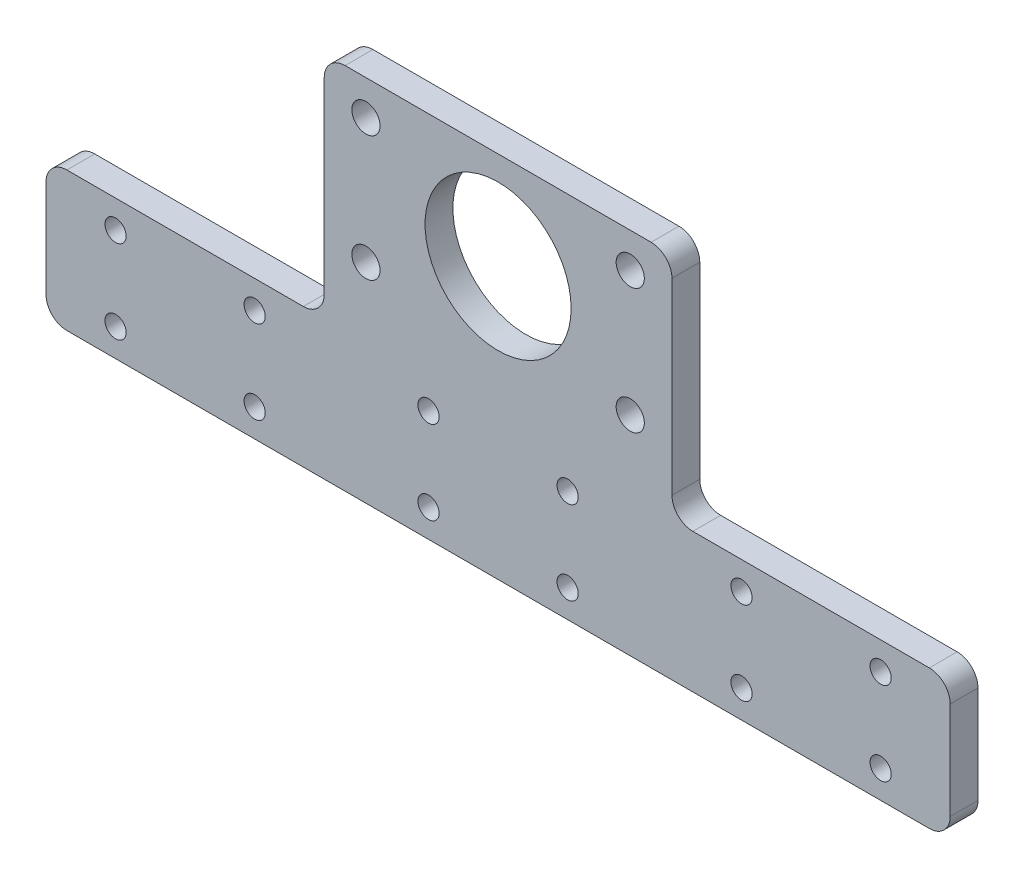
ISO-10303-21;
HEADER;
FILE_DESCRIPTION(('STEP AP214'),'2;1');
FILE_NAME('part.step','',(''),(''),'','','');
FILE_SCHEMA(('AUTOMOTIVE_DESIGN { 1 0 10303 214 1 1 1 1 }'));
ENDSEC;
DATA;
#1=APPLICATION_CONTEXT('core data for automotive mechanical design processes');
#2=APPLICATION_PROTOCOL_DEFINITION('international standard','automotive_design',2000,#1);
#3=PRODUCT_CONTEXT('',#1,'mechanical');
#4=PRODUCT('Part','Part','',(#3));
#5=PRODUCT_RELATED_PRODUCT_CATEGORY('part','',(#4));
#6=PRODUCT_DEFINITION_FORMATION('','',#4);
#7=PRODUCT_DEFINITION_CONTEXT('part definition',#1,'design');
#8=PRODUCT_DEFINITION('design','',#6,#7);
#9=PRODUCT_DEFINITION_SHAPE('','',#8);
#10=(LENGTH_UNIT() NAMED_UNIT(*) SI_UNIT(.MILLI.,.METRE.));
#11=(NAMED_UNIT(*) PLANE_ANGLE_UNIT() SI_UNIT($,.RADIAN.));
#12=(NAMED_UNIT(*) SI_UNIT($,.STERADIAN.) SOLID_ANGLE_UNIT());
#13=UNCERTAINTY_MEASURE_WITH_UNIT(LENGTH_MEASURE(1.E-05),#10,'distance_accuracy_value','');
#14=(GEOMETRIC_REPRESENTATION_CONTEXT(3) GLOBAL_UNCERTAINTY_ASSIGNED_CONTEXT((#13)) GLOBAL_UNIT_ASSIGNED_CONTEXT((#10,
#11,#12)) REPRESENTATION_CONTEXT('',''));
#15=CARTESIAN_POINT('',(0.,0.,0.));
#16=DIRECTION('',(0.,0.,1.));
#17=DIRECTION('',(1.,0.,0.));
#18=AXIS2_PLACEMENT_3D('',#15,#16,#17);
#19=CARTESIAN_POINT('',(-25.,-33.,2.));
#20=DIRECTION('',(1.,0.,0.));
#21=DIRECTION('',(0.,1.,0.));
#22=AXIS2_PLACEMENT_3D('',#19,#20,#21);
#23=PLANE('',#22);
#24=DIRECTION('',(0.,-1.,0.));
#25=VECTOR('',#24,1.);
#26=CARTESIAN_POINT('',(-25.,-33.,-2.));
#27=LINE('',#26,#25);
#28=CARTESIAN_POINT('',(-25.,-3.,-2.));
#29=VERTEX_POINT('',#28);
#30=CARTESIAN_POINT('',(-25.,-30.,-2.));
#31=VERTEX_POINT('',#30);
#32=EDGE_CURVE('E241',#29,#31,#27,.T.);
#33=ORIENTED_EDGE('',*,*,#32,.T.);
#34=DIRECTION('',(0.,0.,-1.));
#35=VECTOR('',#34,1.);
#36=CARTESIAN_POINT('',(-25.,-30.,2.));
#37=LINE('',#36,#35);
#38=CARTESIAN_POINT('',(-25.,-30.,2.));
#39=VERTEX_POINT('',#38);
#40=EDGE_CURVE('E234',#31,#39,#37,.F.);
#41=ORIENTED_EDGE('',*,*,#40,.T.);
#42=DIRECTION('',(0.,-1.,0.));
#43=VECTOR('',#42,1.);
#44=CARTESIAN_POINT('',(-25.,-33.,2.));
#45=LINE('',#44,#43);
#46=CARTESIAN_POINT('',(-25.,-3.,2.));
#47=VERTEX_POINT('',#46);
#48=EDGE_CURVE('E174',#47,#39,#45,.T.);
#49=ORIENTED_EDGE('',*,*,#48,.F.);
#50=DIRECTION('',(0.,0.,-1.));
#51=VECTOR('',#50,1.);
#52=CARTESIAN_POINT('',(-25.,-3.,2.));
#53=LINE('',#52,#51);
#54=EDGE_CURVE('E231',#47,#29,#53,.T.);
#55=ORIENTED_EDGE('',*,*,#54,.T.);
#56=EDGE_LOOP('',(#33,#41,#49,#55));
#57=FACE_BOUND('',#56,.T.);
#58=ADVANCED_FACE('F34',(#57),#23,.F.);
#59=CARTESIAN_POINT('',(-65.,-33.,2.));
#60=DIRECTION('',(0.,-1.,0.));
#61=DIRECTION('',(0.,0.,-1.));
#62=AXIS2_PLACEMENT_3D('',#59,#60,#61);
#63=PLANE('',#62);
#64=DIRECTION('',(-1.,0.,0.));
#65=VECTOR('',#64,1.);
#66=CARTESIAN_POINT('',(-65.,-33.,-2.));
#67=LINE('',#66,#65);
#68=CARTESIAN_POINT('',(-28.,-33.,-2.));
#69=VERTEX_POINT('',#68);
#70=CARTESIAN_POINT('',(-62.,-33.,-2.));
#71=VERTEX_POINT('',#70);
#72=EDGE_CURVE('E243',#69,#71,#67,.T.);
#73=ORIENTED_EDGE('',*,*,#72,.T.);
#74=DIRECTION('',(0.,0.,-1.));
#75=VECTOR('',#74,1.);
#76=CARTESIAN_POINT('',(-62.,-33.,2.));
#77=LINE('',#76,#75);
#78=CARTESIAN_POINT('',(-62.,-33.,2.));
#79=VERTEX_POINT('',#78);
#80=EDGE_CURVE('E229',#71,#79,#77,.F.);
#81=ORIENTED_EDGE('',*,*,#80,.T.);
#82=DIRECTION('',(-1.,0.,0.));
#83=VECTOR('',#82,1.);
#84=CARTESIAN_POINT('',(-65.,-33.,2.));
#85=LINE('',#84,#83);
#86=CARTESIAN_POINT('',(-28.,-33.,2.));
#87=VERTEX_POINT('',#86);
#88=EDGE_CURVE('E178',#87,#79,#85,.T.);
#89=ORIENTED_EDGE('',*,*,#88,.F.);
#90=DIRECTION('',(0.,0.,-1.));
#91=VECTOR('',#90,1.);
#92=CARTESIAN_POINT('',(-28.,-33.,-2.));
#93=LINE('',#92,#91);
#94=EDGE_CURVE('E226',#87,#69,#93,.T.);
#95=ORIENTED_EDGE('',*,*,#94,.T.);
#96=EDGE_LOOP('',(#73,#81,#89,#95));
#97=FACE_BOUND('',#96,.T.);
#98=ADVANCED_FACE('F260',(#97),#63,.F.);
#99=CARTESIAN_POINT('',(-65.,-53.,2.));
#100=DIRECTION('',(1.,0.,0.));
#101=DIRECTION('',(0.,0.,-1.));
#102=AXIS2_PLACEMENT_3D('',#99,#100,#101);
#103=PLANE('',#102);
#104=DIRECTION('',(0.,-1.,0.));
#105=VECTOR('',#104,1.);
#106=CARTESIAN_POINT('',(-65.,-53.,-2.));
#107=LINE('',#106,#105);
#108=CARTESIAN_POINT('',(-65.,-36.,-2.));
#109=VERTEX_POINT('',#108);
#110=CARTESIAN_POINT('',(-65.,-50.,-2.));
#111=VERTEX_POINT('',#110);
#112=EDGE_CURVE('E279',#109,#111,#107,.T.);
#113=ORIENTED_EDGE('',*,*,#112,.T.);
#114=DIRECTION('',(0.,0.,-1.));
#115=VECTOR('',#114,1.);
#116=CARTESIAN_POINT('',(-65.,-50.,2.));
#117=LINE('',#116,#115);
#118=CARTESIAN_POINT('',(-65.,-50.,2.));
#119=VERTEX_POINT('',#118);
#120=EDGE_CURVE('E224',#111,#119,#117,.F.);
#121=ORIENTED_EDGE('',*,*,#120,.T.);
#122=DIRECTION('',(0.,-1.,0.));
#123=VECTOR('',#122,1.);
#124=CARTESIAN_POINT('',(-65.,-53.,2.));
#125=LINE('',#124,#123);
#126=CARTESIAN_POINT('',(-65.,-36.,2.));
#127=VERTEX_POINT('',#126);
#128=EDGE_CURVE('E262',#127,#119,#125,.T.);
#129=ORIENTED_EDGE('',*,*,#128,.F.);
#130=DIRECTION('',(0.,0.,-1.));
#131=VECTOR('',#130,1.);
#132=CARTESIAN_POINT('',(-65.,-36.,2.));
#133=LINE('',#132,#131);
#134=EDGE_CURVE('E221',#127,#109,#133,.T.);
#135=ORIENTED_EDGE('',*,*,#134,.T.);
#136=EDGE_LOOP('',(#113,#121,#129,#135));
#137=FACE_BOUND('',#136,.T.);
#138=ADVANCED_FACE('F311',(#137),#103,.F.);
#139=CARTESIAN_POINT('',(65.,-53.,2.));
#140=DIRECTION('',(0.,1.,0.));
#141=DIRECTION('',(0.,0.,1.));
#142=AXIS2_PLACEMENT_3D('',#139,#140,#141);
#143=PLANE('',#142);
#144=DIRECTION('',(1.,0.,0.));
#145=VECTOR('',#144,1.);
#146=CARTESIAN_POINT('',(65.,-53.,-2.));
#147=LINE('',#146,#145);
#148=CARTESIAN_POINT('',(-62.,-53.,-2.));
#149=VERTEX_POINT('',#148);
#150=CARTESIAN_POINT('',(62.,-53.,-2.));
#151=VERTEX_POINT('',#150);
#152=EDGE_CURVE('E282',#149,#151,#147,.T.);
#153=ORIENTED_EDGE('',*,*,#152,.T.);
#154=DIRECTION('',(0.,0.,-1.));
#155=VECTOR('',#154,1.);
#156=CARTESIAN_POINT('',(62.,-53.,2.));
#157=LINE('',#156,#155);
#158=CARTESIAN_POINT('',(62.,-53.,2.));
#159=VERTEX_POINT('',#158);
#160=EDGE_CURVE('E219',#151,#159,#157,.F.);
#161=ORIENTED_EDGE('',*,*,#160,.T.);
#162=DIRECTION('',(1.,0.,0.));
#163=VECTOR('',#162,1.);
#164=CARTESIAN_POINT('',(65.,-53.,2.));
#165=LINE('',#164,#163);
#166=CARTESIAN_POINT('',(-62.,-53.,2.));
#167=VERTEX_POINT('',#166);
#168=EDGE_CURVE('E265',#167,#159,#165,.T.);
#169=ORIENTED_EDGE('',*,*,#168,.F.);
#170=DIRECTION('',(0.,0.,-1.));
#171=VECTOR('',#170,1.);
#172=CARTESIAN_POINT('',(-62.,-53.,2.));
#173=LINE('',#172,#171);
#174=EDGE_CURVE('E216',#167,#149,#173,.T.);
#175=ORIENTED_EDGE('',*,*,#174,.T.);
#176=EDGE_LOOP('',(#153,#161,#169,#175));
#177=FACE_BOUND('',#176,.T.);
#178=ADVANCED_FACE('F740',(#177),#143,.F.);
#179=CARTESIAN_POINT('',(65.,-33.,2.));
#180=DIRECTION('',(-1.,0.,0.));
#181=DIRECTION('',(0.,0.,1.));
#182=AXIS2_PLACEMENT_3D('',#179,#180,#181);
#183=PLANE('',#182);
#184=DIRECTION('',(0.,1.,0.));
#185=VECTOR('',#184,1.);
#186=CARTESIAN_POINT('',(65.,-33.,-2.));
#187=LINE('',#186,#185);
#188=CARTESIAN_POINT('',(65.,-50.,-2.));
#189=VERTEX_POINT('',#188);
#190=CARTESIAN_POINT('',(65.,-36.,-2.));
#191=VERTEX_POINT('',#190);
#192=EDGE_CURVE('E285',#189,#191,#187,.T.);
#193=ORIENTED_EDGE('',*,*,#192,.T.);
#194=DIRECTION('',(0.,0.,-1.));
#195=VECTOR('',#194,1.);
#196=CARTESIAN_POINT('',(65.,-36.,2.));
#197=LINE('',#196,#195);
#198=CARTESIAN_POINT('',(65.,-36.,2.));
#199=VERTEX_POINT('',#198);
#200=EDGE_CURVE('E214',#191,#199,#197,.F.);
#201=ORIENTED_EDGE('',*,*,#200,.T.);
#202=DIRECTION('',(0.,1.,0.));
#203=VECTOR('',#202,1.);
#204=CARTESIAN_POINT('',(65.,-33.,2.));
#205=LINE('',#204,#203);
#206=CARTESIAN_POINT('',(65.,-50.,2.));
#207=VERTEX_POINT('',#206);
#208=EDGE_CURVE('E271',#207,#199,#205,.T.);
#209=ORIENTED_EDGE('',*,*,#208,.F.);
#210=DIRECTION('',(0.,0.,-1.));
#211=VECTOR('',#210,1.);
#212=CARTESIAN_POINT('',(65.,-50.,2.));
#213=LINE('',#212,#211);
#214=EDGE_CURVE('E211',#207,#189,#213,.T.);
#215=ORIENTED_EDGE('',*,*,#214,.T.);
#216=EDGE_LOOP('',(#193,#201,#209,#215));
#217=FACE_BOUND('',#216,.T.);
#218=ADVANCED_FACE('F304',(#217),#183,.F.);
#219=CARTESIAN_POINT('',(25.,-33.,2.));
#220=DIRECTION('',(0.,-1.,0.));
#221=DIRECTION('',(0.,0.,-1.));
#222=AXIS2_PLACEMENT_3D('',#219,#220,#221);
#223=PLANE('',#222);
#224=DIRECTION('',(-1.,0.,0.));
#225=VECTOR('',#224,1.);
#226=CARTESIAN_POINT('',(25.,-33.,-2.));
#227=LINE('',#226,#225);
#228=CARTESIAN_POINT('',(62.,-33.,-2.));
#229=VERTEX_POINT('',#228);
#230=CARTESIAN_POINT('',(28.,-33.,-2.));
#231=VERTEX_POINT('',#230);
#232=EDGE_CURVE('E180',#229,#231,#227,.T.);
#233=ORIENTED_EDGE('',*,*,#232,.T.);
#234=DIRECTION('',(0.,0.,-1.));
#235=VECTOR('',#234,1.);
#236=CARTESIAN_POINT('',(28.,-33.,2.));
#237=LINE('',#236,#235);
#238=CARTESIAN_POINT('',(28.,-33.,2.));
#239=VERTEX_POINT('',#238);
#240=EDGE_CURVE('E49',#231,#239,#237,.F.);
#241=ORIENTED_EDGE('',*,*,#240,.T.);
#242=DIRECTION('',(-1.,0.,0.));
#243=VECTOR('',#242,1.);
#244=CARTESIAN_POINT('',(25.,-33.,2.));
#245=LINE('',#244,#243);
#246=CARTESIAN_POINT('',(62.,-33.,2.));
#247=VERTEX_POINT('',#246);
#248=EDGE_CURVE('E273',#247,#239,#245,.T.);
#249=ORIENTED_EDGE('',*,*,#248,.F.);
#250=DIRECTION('',(0.,0.,-1.));
#251=VECTOR('',#250,1.);
#252=CARTESIAN_POINT('',(62.,-33.,2.));
#253=LINE('',#252,#251);
#254=EDGE_CURVE('E207',#247,#229,#253,.T.);
#255=ORIENTED_EDGE('',*,*,#254,.T.);
#256=EDGE_LOOP('',(#233,#241,#249,#255));
#257=FACE_BOUND('',#256,.T.);
#258=ADVANCED_FACE('F288',(#257),#223,.F.);
#259=CARTESIAN_POINT('',(25.,0.,2.));
#260=DIRECTION('',(-1.,0.,0.));
#261=DIRECTION('',(0.,-1.,0.));
#262=AXIS2_PLACEMENT_3D('',#259,#260,#261);
#263=PLANE('',#262);
#264=DIRECTION('',(0.,1.,0.));
#265=VECTOR('',#264,1.);
#266=CARTESIAN_POINT('',(25.,0.,-2.));
#267=LINE('',#266,#265);
#268=CARTESIAN_POINT('',(25.,-30.,-2.));
#269=VERTEX_POINT('',#268);
#270=CARTESIAN_POINT('',(25.,-3.,-2.));
#271=VERTEX_POINT('',#270);
#272=EDGE_CURVE('E175',#269,#271,#267,.T.);
#273=ORIENTED_EDGE('',*,*,#272,.T.);
#274=DIRECTION('',(0.,0.,-1.));
#275=VECTOR('',#274,1.);
#276=CARTESIAN_POINT('',(25.,-3.,2.));
#277=LINE('',#276,#275);
#278=CARTESIAN_POINT('',(25.,-3.,2.));
#279=VERTEX_POINT('',#278);
#280=EDGE_CURVE('E153',#271,#279,#277,.F.);
#281=ORIENTED_EDGE('',*,*,#280,.T.);
#282=DIRECTION('',(0.,1.,0.));
#283=VECTOR('',#282,1.);
#284=CARTESIAN_POINT('',(25.,0.,2.));
#285=LINE('',#284,#283);
#286=CARTESIAN_POINT('',(25.,-30.,2.));
#287=VERTEX_POINT('',#286);
#288=EDGE_CURVE('E275',#287,#279,#285,.T.);
#289=ORIENTED_EDGE('',*,*,#288,.F.);
#290=DIRECTION('',(0.,0.,-1.));
#291=VECTOR('',#290,1.);
#292=CARTESIAN_POINT('',(25.,-30.,-2.));
#293=LINE('',#292,#291);
#294=EDGE_CURVE('E158',#287,#269,#293,.T.);
#295=ORIENTED_EDGE('',*,*,#294,.T.);
#296=EDGE_LOOP('',(#273,#281,#289,#295));
#297=FACE_BOUND('',#296,.T.);
#298=ADVANCED_FACE('F296',(#297),#263,.F.);
#299=CARTESIAN_POINT('',(-25.,0.,2.));
#300=DIRECTION('',(0.,-1.,0.));
#301=DIRECTION('',(0.,0.,-1.));
#302=AXIS2_PLACEMENT_3D('',#299,#300,#301);
#303=PLANE('',#302);
#304=DIRECTION('',(-1.,0.,0.));
#305=VECTOR('',#304,1.);
#306=CARTESIAN_POINT('',(-25.,0.,2.));
#307=LINE('',#306,#305);
#308=CARTESIAN_POINT('',(22.,0.,2.));
#309=VERTEX_POINT('',#308);
#310=CARTESIAN_POINT('',(-22.,0.,2.));
#311=VERTEX_POINT('',#310);
#312=EDGE_CURVE('E168',#309,#311,#307,.T.);
#313=ORIENTED_EDGE('',*,*,#312,.F.);
#314=DIRECTION('',(0.,0.,-1.));
#315=VECTOR('',#314,1.);
#316=CARTESIAN_POINT('',(22.,0.,2.));
#317=LINE('',#316,#315);
#318=CARTESIAN_POINT('',(22.,0.,-2.));
#319=VERTEX_POINT('',#318);
#320=EDGE_CURVE('E152',#309,#319,#317,.T.);
#321=ORIENTED_EDGE('',*,*,#320,.T.);
#322=DIRECTION('',(-1.,0.,0.));
#323=VECTOR('',#322,1.);
#324=CARTESIAN_POINT('',(-25.,0.,-2.));
#325=LINE('',#324,#323);
#326=CARTESIAN_POINT('',(-22.,0.,-2.));
#327=VERTEX_POINT('',#326);
#328=EDGE_CURVE('E165',#319,#327,#325,.T.);
#329=ORIENTED_EDGE('',*,*,#328,.T.);
#330=DIRECTION('',(0.,0.,-1.));
#331=VECTOR('',#330,1.);
#332=CARTESIAN_POINT('',(-22.,0.,2.));
#333=LINE('',#332,#331);
#334=EDGE_CURVE('E170',#327,#311,#333,.F.);
#335=ORIENTED_EDGE('',*,*,#334,.T.);
#336=EDGE_LOOP('',(#313,#321,#329,#335));
#337=FACE_BOUND('',#336,.T.);
#338=ADVANCED_FACE('F164',(#337),#303,.F.);
#339=CARTESIAN_POINT('',(0.,0.,2.));
#340=DIRECTION('',(0.,0.,-1.));
#341=DIRECTION('',(-1.,0.,0.));
#342=AXIS2_PLACEMENT_3D('',#339,#340,#341);
#343=PLANE('',#342);
#344=CARTESIAN_POINT('',(0.,-14.,2.));
#345=DIRECTION('',(0.,0.,1.));
#346=DIRECTION('',(1.,0.,0.));
#347=AXIS2_PLACEMENT_3D('',#344,#345,#346);
#348=CIRCLE('',#347,10.5);
#349=CARTESIAN_POINT('',(10.5,-14.,2.));
#350=VERTEX_POINT('',#349);
#351=EDGE_CURVE('E512',#350,#350,#348,.T.);
#352=ORIENTED_EDGE('',*,*,#351,.F.);
#353=EDGE_LOOP('',(#352));
#354=FACE_BOUND('',#353,.T.);
#355=CARTESIAN_POINT('',(-10.,-37.,2.));
#356=DIRECTION('',(0.,0.,-1.));
#357=DIRECTION('',(-1.,0.,0.));
#358=AXIS2_PLACEMENT_3D('',#355,#356,#357);
#359=CIRCLE('',#358,1.525);
#360=CARTESIAN_POINT('',(-11.525,-37.,2.));
#361=VERTEX_POINT('',#360);
#362=EDGE_CURVE('E561',#361,#361,#359,.T.);
#363=ORIENTED_EDGE('',*,*,#362,.T.);
#364=EDGE_LOOP('',(#363));
#365=FACE_BOUND('',#364,.T.);
#366=CARTESIAN_POINT('',(-35.,-37.,2.));
#367=DIRECTION('',(0.,0.,-1.));
#368=DIRECTION('',(-1.,0.,0.));
#369=AXIS2_PLACEMENT_3D('',#366,#367,#368);
#370=CIRCLE('',#369,1.525);
#371=CARTESIAN_POINT('',(-36.525,-37.,2.));
#372=VERTEX_POINT('',#371);
#373=EDGE_CURVE('E558',#372,#372,#370,.T.);
#374=ORIENTED_EDGE('',*,*,#373,.T.);
#375=EDGE_LOOP('',(#374));
#376=FACE_BOUND('',#375,.T.);
#377=CARTESIAN_POINT('',(-55.,-37.,2.));
#378=DIRECTION('',(0.,0.,-1.));
#379=DIRECTION('',(-1.,0.,0.));
#380=AXIS2_PLACEMENT_3D('',#377,#378,#379);
#381=CIRCLE('',#380,1.525);
#382=CARTESIAN_POINT('',(-56.525,-37.,2.));
#383=VERTEX_POINT('',#382);
#384=EDGE_CURVE('E555',#383,#383,#381,.T.);
#385=ORIENTED_EDGE('',*,*,#384,.T.);
#386=EDGE_LOOP('',(#385));
#387=FACE_BOUND('',#386,.T.);
#388=CARTESIAN_POINT('',(-55.,-49.,2.));
#389=DIRECTION('',(0.,0.,-1.));
#390=DIRECTION('',(-1.,0.,0.));
#391=AXIS2_PLACEMENT_3D('',#388,#389,#390);
#392=CIRCLE('',#391,1.525);
#393=CARTESIAN_POINT('',(-56.525,-49.,2.));
#394=VERTEX_POINT('',#393);
#395=EDGE_CURVE('E552',#394,#394,#392,.T.);
#396=ORIENTED_EDGE('',*,*,#395,.T.);
#397=EDGE_LOOP('',(#396));
#398=FACE_BOUND('',#397,.T.);
#399=CARTESIAN_POINT('',(-35.,-49.,2.));
#400=DIRECTION('',(0.,0.,-1.));
#401=DIRECTION('',(-1.,0.,0.));
#402=AXIS2_PLACEMENT_3D('',#399,#400,#401);
#403=CIRCLE('',#402,1.525);
#404=CARTESIAN_POINT('',(-36.525,-49.,2.));
#405=VERTEX_POINT('',#404);
#406=EDGE_CURVE('E549',#405,#405,#403,.T.);
#407=ORIENTED_EDGE('',*,*,#406,.T.);
#408=EDGE_LOOP('',(#407));
#409=FACE_BOUND('',#408,.T.);
#410=CARTESIAN_POINT('',(-10.,-49.,2.));
#411=DIRECTION('',(0.,0.,-1.));
#412=DIRECTION('',(-1.,0.,0.));
#413=AXIS2_PLACEMENT_3D('',#410,#411,#412);
#414=CIRCLE('',#413,1.525);
#415=CARTESIAN_POINT('',(-11.525,-49.,2.));
#416=VERTEX_POINT('',#415);
#417=EDGE_CURVE('E546',#416,#416,#414,.T.);
#418=ORIENTED_EDGE('',*,*,#417,.T.);
#419=EDGE_LOOP('',(#418));
#420=FACE_BOUND('',#419,.T.);
#421=CARTESIAN_POINT('',(9.99999999999999,-49.,2.));
#422=DIRECTION('',(0.,0.,-1.));
#423=DIRECTION('',(-1.,0.,0.));
#424=AXIS2_PLACEMENT_3D('',#421,#422,#423);
#425=CIRCLE('',#424,1.525);
#426=CARTESIAN_POINT('',(8.47499999999999,-49.,2.));
#427=VERTEX_POINT('',#426);
#428=EDGE_CURVE('E543',#427,#427,#425,.T.);
#429=ORIENTED_EDGE('',*,*,#428,.T.);
#430=EDGE_LOOP('',(#429));
#431=FACE_BOUND('',#430,.T.);
#432=CARTESIAN_POINT('',(35.,-49.,2.));
#433=DIRECTION('',(0.,0.,-1.));
#434=DIRECTION('',(-1.,0.,0.));
#435=AXIS2_PLACEMENT_3D('',#432,#433,#434);
#436=CIRCLE('',#435,1.525);
#437=CARTESIAN_POINT('',(33.475,-49.,2.));
#438=VERTEX_POINT('',#437);
#439=EDGE_CURVE('E540',#438,#438,#436,.T.);
#440=ORIENTED_EDGE('',*,*,#439,.T.);
#441=EDGE_LOOP('',(#440));
#442=FACE_BOUND('',#441,.T.);
#443=CARTESIAN_POINT('',(9.99999999999999,-37.,2.));
#444=DIRECTION('',(0.,0.,-1.));
#445=DIRECTION('',(-1.,0.,0.));
#446=AXIS2_PLACEMENT_3D('',#443,#444,#445);
#447=CIRCLE('',#446,1.525);
#448=CARTESIAN_POINT('',(8.47499999999999,-37.,2.));
#449=VERTEX_POINT('',#448);
#450=EDGE_CURVE('E537',#449,#449,#447,.T.);
#451=ORIENTED_EDGE('',*,*,#450,.T.);
#452=EDGE_LOOP('',(#451));
#453=FACE_BOUND('',#452,.T.);
#454=CARTESIAN_POINT('',(35.,-37.,2.));
#455=DIRECTION('',(0.,0.,-1.));
#456=DIRECTION('',(-1.,0.,0.));
#457=AXIS2_PLACEMENT_3D('',#454,#455,#456);
#458=CIRCLE('',#457,1.525);
#459=CARTESIAN_POINT('',(33.475,-37.,2.));
#460=VERTEX_POINT('',#459);
#461=EDGE_CURVE('E534',#460,#460,#458,.T.);
#462=ORIENTED_EDGE('',*,*,#461,.T.);
#463=EDGE_LOOP('',(#462));
#464=FACE_BOUND('',#463,.T.);
#465=CARTESIAN_POINT('',(55.,-37.,2.));
#466=DIRECTION('',(0.,0.,-1.));
#467=DIRECTION('',(-1.,0.,0.));
#468=AXIS2_PLACEMENT_3D('',#465,#466,#467);
#469=CIRCLE('',#468,1.525);
#470=CARTESIAN_POINT('',(53.475,-37.,2.));
#471=VERTEX_POINT('',#470);
#472=EDGE_CURVE('E531',#471,#471,#469,.T.);
#473=ORIENTED_EDGE('',*,*,#472,.T.);
#474=EDGE_LOOP('',(#473));
#475=FACE_BOUND('',#474,.T.);
#476=CARTESIAN_POINT('',(55.,-49.,2.));
#477=DIRECTION('',(0.,0.,-1.));
#478=DIRECTION('',(-1.,0.,0.));
#479=AXIS2_PLACEMENT_3D('',#476,#477,#478);
#480=CIRCLE('',#479,1.525);
#481=CARTESIAN_POINT('',(53.475,-49.,2.));
#482=VERTEX_POINT('',#481);
#483=EDGE_CURVE('E528',#482,#482,#480,.T.);
#484=ORIENTED_EDGE('',*,*,#483,.T.);
#485=EDGE_LOOP('',(#484));
#486=FACE_BOUND('',#485,.T.);
#487=CARTESIAN_POINT('',(-19.,-23.,2.));
#488=DIRECTION('',(0.,0.,-1.));
#489=DIRECTION('',(-1.,0.,0.));
#490=AXIS2_PLACEMENT_3D('',#487,#488,#489);
#491=CIRCLE('',#490,2.025);
#492=CARTESIAN_POINT('',(-21.025,-23.,2.));
#493=VERTEX_POINT('',#492);
#494=EDGE_CURVE('E250',#493,#493,#491,.T.);
#495=ORIENTED_EDGE('',*,*,#494,.T.);
#496=EDGE_LOOP('',(#495));
#497=FACE_BOUND('',#496,.T.);
#498=CARTESIAN_POINT('',(19.,-5.,2.));
#499=DIRECTION('',(0.,0.,-1.));
#500=DIRECTION('',(-1.,0.,0.));
#501=AXIS2_PLACEMENT_3D('',#498,#499,#500);
#502=CIRCLE('',#501,2.025);
#503=CARTESIAN_POINT('',(16.975,-5.,2.));
#504=VERTEX_POINT('',#503);
#505=EDGE_CURVE('E441',#504,#504,#502,.T.);
#506=ORIENTED_EDGE('',*,*,#505,.T.);
#507=EDGE_LOOP('',(#506));
#508=FACE_BOUND('',#507,.T.);
#509=CARTESIAN_POINT('',(19.,-23.,2.));
#510=DIRECTION('',(0.,0.,-1.));
#511=DIRECTION('',(-1.,0.,0.));
#512=AXIS2_PLACEMENT_3D('',#509,#510,#511);
#513=CIRCLE('',#512,2.025);
#514=CARTESIAN_POINT('',(16.975,-23.,2.));
#515=VERTEX_POINT('',#514);
#516=EDGE_CURVE('E434',#515,#515,#513,.T.);
#517=ORIENTED_EDGE('',*,*,#516,.T.);
#518=EDGE_LOOP('',(#517));
#519=FACE_BOUND('',#518,.T.);
#520=CARTESIAN_POINT('',(-19.,-5.,2.));
#521=DIRECTION('',(0.,0.,-1.));
#522=DIRECTION('',(-1.,0.,0.));
#523=AXIS2_PLACEMENT_3D('',#520,#521,#522);
#524=CIRCLE('',#523,2.025);
#525=CARTESIAN_POINT('',(-21.025,-5.,2.));
#526=VERTEX_POINT('',#525);
#527=EDGE_CURVE('E431',#526,#526,#524,.T.);
#528=ORIENTED_EDGE('',*,*,#527,.T.);
#529=EDGE_LOOP('',(#528));
#530=FACE_BOUND('',#529,.T.);
#531=ORIENTED_EDGE('',*,*,#288,.T.);
#532=CARTESIAN_POINT('',(22.,-3.,2.));
#533=DIRECTION('',(0.,0.,-1.));
#534=DIRECTION('',(-1.,0.,0.));
#535=AXIS2_PLACEMENT_3D('',#532,#533,#534);
#536=CIRCLE('',#535,3.);
#537=EDGE_CURVE('E205',#279,#309,#536,.F.);
#538=ORIENTED_EDGE('',*,*,#537,.T.);
#539=ORIENTED_EDGE('',*,*,#312,.T.);
#540=CARTESIAN_POINT('',(-22.,-3.,2.));
#541=DIRECTION('',(0.,0.,-1.));
#542=DIRECTION('',(-1.,0.,0.));
#543=AXIS2_PLACEMENT_3D('',#540,#541,#542);
#544=CIRCLE('',#543,3.);
#545=EDGE_CURVE('E196',#311,#47,#544,.F.);
#546=ORIENTED_EDGE('',*,*,#545,.T.);
#547=ORIENTED_EDGE('',*,*,#48,.T.);
#548=CARTESIAN_POINT('',(-28.,-30.,2.));
#549=DIRECTION('',(0.,0.,-1.));
#550=DIRECTION('',(-1.,0.,0.));
#551=AXIS2_PLACEMENT_3D('',#548,#549,#550);
#552=CIRCLE('',#551,3.);
#553=EDGE_CURVE('E11',#39,#87,#552,.T.);
#554=ORIENTED_EDGE('',*,*,#553,.T.);
#555=ORIENTED_EDGE('',*,*,#88,.T.);
#556=CARTESIAN_POINT('',(-62.,-36.,2.));
#557=DIRECTION('',(0.,0.,-1.));
#558=DIRECTION('',(-1.,0.,0.));
#559=AXIS2_PLACEMENT_3D('',#556,#557,#558);
#560=CIRCLE('',#559,3.);
#561=EDGE_CURVE('E198',#79,#127,#560,.F.);
#562=ORIENTED_EDGE('',*,*,#561,.T.);
#563=ORIENTED_EDGE('',*,*,#128,.T.);
#564=CARTESIAN_POINT('',(-62.,-50.,2.));
#565=DIRECTION('',(0.,0.,-1.));
#566=DIRECTION('',(-1.,0.,0.));
#567=AXIS2_PLACEMENT_3D('',#564,#565,#566);
#568=CIRCLE('',#567,3.);
#569=EDGE_CURVE('E200',#119,#167,#568,.F.);
#570=ORIENTED_EDGE('',*,*,#569,.T.);
#571=ORIENTED_EDGE('',*,*,#168,.T.);
#572=CARTESIAN_POINT('',(62.,-50.,2.));
#573=DIRECTION('',(0.,0.,-1.));
#574=DIRECTION('',(-1.,0.,0.));
#575=AXIS2_PLACEMENT_3D('',#572,#573,#574);
#576=CIRCLE('',#575,3.);
#577=EDGE_CURVE('E202',#159,#207,#576,.F.);
#578=ORIENTED_EDGE('',*,*,#577,.T.);
#579=ORIENTED_EDGE('',*,*,#208,.T.);
#580=CARTESIAN_POINT('',(62.,-36.,2.));
#581=DIRECTION('',(0.,0.,-1.));
#582=DIRECTION('',(-1.,0.,0.));
#583=AXIS2_PLACEMENT_3D('',#580,#581,#582);
#584=CIRCLE('',#583,3.);
#585=EDGE_CURVE('E56',#199,#247,#584,.F.);
#586=ORIENTED_EDGE('',*,*,#585,.T.);
#587=ORIENTED_EDGE('',*,*,#248,.T.);
#588=CARTESIAN_POINT('',(28.,-30.,2.));
#589=DIRECTION('',(0.,0.,-1.));
#590=DIRECTION('',(-1.,0.,0.));
#591=AXIS2_PLACEMENT_3D('',#588,#589,#590);
#592=CIRCLE('',#591,3.);
#593=EDGE_CURVE('E238',#239,#287,#592,.T.);
#594=ORIENTED_EDGE('',*,*,#593,.T.);
#595=EDGE_LOOP('',(#531,#538,#539,#546,#547,#554,#555,#562,#563,#570,#571,#578,#579,#586,#587,#594));
#596=FACE_BOUND('',#595,.T.);
#597=ADVANCED_FACE('F257',(#354,#365,#376,#387,#398,#409,#420,#431,#442,#453,#464,#475,#486,
#497,#508,#519,#530,#596),#343,.F.);
#598=CARTESIAN_POINT('',(0.,0.,-2.));
#599=DIRECTION('',(0.,0.,-1.));
#600=DIRECTION('',(-1.,0.,0.));
#601=AXIS2_PLACEMENT_3D('',#598,#599,#600);
#602=PLANE('',#601);
#603=CARTESIAN_POINT('',(0.,-14.,-2.));
#604=DIRECTION('',(0.,0.,1.));
#605=DIRECTION('',(1.,0.,0.));
#606=AXIS2_PLACEMENT_3D('',#603,#604,#605);
#607=CIRCLE('',#606,10.5);
#608=CARTESIAN_POINT('',(10.5,-14.,-2.));
#609=VERTEX_POINT('',#608);
#610=EDGE_CURVE('E368',#609,#609,#607,.T.);
#611=ORIENTED_EDGE('',*,*,#610,.T.);
#612=EDGE_LOOP('',(#611));
#613=FACE_BOUND('',#612,.T.);
#614=CARTESIAN_POINT('',(-10.,-37.,-2.));
#615=DIRECTION('',(0.,0.,-1.));
#616=DIRECTION('',(1.,0.,0.));
#617=AXIS2_PLACEMENT_3D('',#614,#615,#616);
#618=CIRCLE('',#617,1.525);
#619=CARTESIAN_POINT('',(-8.475,-37.,-2.));
#620=VERTEX_POINT('',#619);
#621=EDGE_CURVE('E372',#620,#620,#618,.T.);
#622=ORIENTED_EDGE('',*,*,#621,.F.);
#623=EDGE_LOOP('',(#622));
#624=FACE_BOUND('',#623,.T.);
#625=CARTESIAN_POINT('',(-35.,-37.,-2.));
#626=DIRECTION('',(0.,0.,-1.));
#627=DIRECTION('',(1.,0.,0.));
#628=AXIS2_PLACEMENT_3D('',#625,#626,#627);
#629=CIRCLE('',#628,1.525);
#630=CARTESIAN_POINT('',(-33.475,-37.,-2.));
#631=VERTEX_POINT('',#630);
#632=EDGE_CURVE('E376',#631,#631,#629,.T.);
#633=ORIENTED_EDGE('',*,*,#632,.F.);
#634=EDGE_LOOP('',(#633));
#635=FACE_BOUND('',#634,.T.);
#636=CARTESIAN_POINT('',(-55.,-37.,-2.));
#637=DIRECTION('',(0.,0.,-1.));
#638=DIRECTION('',(1.,0.,0.));
#639=AXIS2_PLACEMENT_3D('',#636,#637,#638);
#640=CIRCLE('',#639,1.525);
#641=CARTESIAN_POINT('',(-53.475,-37.,-2.));
#642=VERTEX_POINT('',#641);
#643=EDGE_CURVE('E380',#642,#642,#640,.T.);
#644=ORIENTED_EDGE('',*,*,#643,.F.);
#645=EDGE_LOOP('',(#644));
#646=FACE_BOUND('',#645,.T.);
#647=CARTESIAN_POINT('',(-55.,-49.,-2.));
#648=DIRECTION('',(0.,0.,-1.));
#649=DIRECTION('',(-1.,0.,0.));
#650=AXIS2_PLACEMENT_3D('',#647,#648,#649);
#651=CIRCLE('',#650,1.525);
#652=CARTESIAN_POINT('',(-56.525,-49.,-2.));
#653=VERTEX_POINT('',#652);
#654=EDGE_CURVE('E384',#653,#653,#651,.T.);
#655=ORIENTED_EDGE('',*,*,#654,.F.);
#656=EDGE_LOOP('',(#655));
#657=FACE_BOUND('',#656,.T.);
#658=CARTESIAN_POINT('',(-35.,-49.,-2.));
#659=DIRECTION('',(0.,0.,-1.));
#660=DIRECTION('',(-1.,0.,0.));
#661=AXIS2_PLACEMENT_3D('',#658,#659,#660);
#662=CIRCLE('',#661,1.525);
#663=CARTESIAN_POINT('',(-36.525,-49.,-2.));
#664=VERTEX_POINT('',#663);
#665=EDGE_CURVE('E388',#664,#664,#662,.T.);
#666=ORIENTED_EDGE('',*,*,#665,.F.);
#667=EDGE_LOOP('',(#666));
#668=FACE_BOUND('',#667,.T.);
#669=CARTESIAN_POINT('',(-10.,-49.,-2.));
#670=DIRECTION('',(0.,0.,-1.));
#671=DIRECTION('',(-1.,0.,0.));
#672=AXIS2_PLACEMENT_3D('',#669,#670,#671);
#673=CIRCLE('',#672,1.525);
#674=CARTESIAN_POINT('',(-11.525,-49.,-2.));
#675=VERTEX_POINT('',#674);
#676=EDGE_CURVE('E392',#675,#675,#673,.T.);
#677=ORIENTED_EDGE('',*,*,#676,.F.);
#678=EDGE_LOOP('',(#677));
#679=FACE_BOUND('',#678,.T.);
#680=CARTESIAN_POINT('',(9.99999999999999,-49.,-2.));
#681=DIRECTION('',(0.,0.,-1.));
#682=DIRECTION('',(-1.,0.,0.));
#683=AXIS2_PLACEMENT_3D('',#680,#681,#682);
#684=CIRCLE('',#683,1.525);
#685=CARTESIAN_POINT('',(8.47499999999999,-49.,-2.));
#686=VERTEX_POINT('',#685);
#687=EDGE_CURVE('E396',#686,#686,#684,.T.);
#688=ORIENTED_EDGE('',*,*,#687,.F.);
#689=EDGE_LOOP('',(#688));
#690=FACE_BOUND('',#689,.T.);
#691=CARTESIAN_POINT('',(35.,-49.,-2.));
#692=DIRECTION('',(0.,0.,-1.));
#693=DIRECTION('',(-1.,0.,0.));
#694=AXIS2_PLACEMENT_3D('',#691,#692,#693);
#695=CIRCLE('',#694,1.525);
#696=CARTESIAN_POINT('',(33.475,-49.,-2.));
#697=VERTEX_POINT('',#696);
#698=EDGE_CURVE('E400',#697,#697,#695,.T.);
#699=ORIENTED_EDGE('',*,*,#698,.F.);
#700=EDGE_LOOP('',(#699));
#701=FACE_BOUND('',#700,.T.);
#702=CARTESIAN_POINT('',(9.99999999999999,-37.,-2.));
#703=DIRECTION('',(0.,0.,-1.));
#704=DIRECTION('',(1.,0.,0.));
#705=AXIS2_PLACEMENT_3D('',#702,#703,#704);
#706=CIRCLE('',#705,1.525);
#707=CARTESIAN_POINT('',(11.525,-37.,-2.));
#708=VERTEX_POINT('',#707);
#709=EDGE_CURVE('E404',#708,#708,#706,.T.);
#710=ORIENTED_EDGE('',*,*,#709,.F.);
#711=EDGE_LOOP('',(#710));
#712=FACE_BOUND('',#711,.T.);
#713=CARTESIAN_POINT('',(35.,-37.,-2.));
#714=DIRECTION('',(0.,0.,-1.));
#715=DIRECTION('',(1.,0.,0.));
#716=AXIS2_PLACEMENT_3D('',#713,#714,#715);
#717=CIRCLE('',#716,1.525);
#718=CARTESIAN_POINT('',(36.525,-37.,-2.));
#719=VERTEX_POINT('',#718);
#720=EDGE_CURVE('E408',#719,#719,#717,.T.);
#721=ORIENTED_EDGE('',*,*,#720,.F.);
#722=EDGE_LOOP('',(#721));
#723=FACE_BOUND('',#722,.T.);
#724=CARTESIAN_POINT('',(55.,-37.,-2.));
#725=DIRECTION('',(0.,0.,-1.));
#726=DIRECTION('',(1.,0.,0.));
#727=AXIS2_PLACEMENT_3D('',#724,#725,#726);
#728=CIRCLE('',#727,1.525);
#729=CARTESIAN_POINT('',(56.525,-37.,-2.));
#730=VERTEX_POINT('',#729);
#731=EDGE_CURVE('E412',#730,#730,#728,.T.);
#732=ORIENTED_EDGE('',*,*,#731,.F.);
#733=EDGE_LOOP('',(#732));
#734=FACE_BOUND('',#733,.T.);
#735=CARTESIAN_POINT('',(55.,-49.,-2.));
#736=DIRECTION('',(0.,0.,-1.));
#737=DIRECTION('',(-1.,0.,0.));
#738=AXIS2_PLACEMENT_3D('',#735,#736,#737);
#739=CIRCLE('',#738,1.525);
#740=CARTESIAN_POINT('',(53.475,-49.,-2.));
#741=VERTEX_POINT('',#740);
#742=EDGE_CURVE('E416',#741,#741,#739,.T.);
#743=ORIENTED_EDGE('',*,*,#742,.F.);
#744=EDGE_LOOP('',(#743));
#745=FACE_BOUND('',#744,.T.);
#746=CARTESIAN_POINT('',(-19.,-23.,-2.));
#747=DIRECTION('',(0.,0.,1.));
#748=DIRECTION('',(1.,0.,0.));
#749=AXIS2_PLACEMENT_3D('',#746,#747,#748);
#750=CIRCLE('',#749,2.025);
#751=CARTESIAN_POINT('',(-16.975,-23.,-2.));
#752=VERTEX_POINT('',#751);
#753=EDGE_CURVE('E420',#752,#752,#750,.T.);
#754=ORIENTED_EDGE('',*,*,#753,.T.);
#755=EDGE_LOOP('',(#754));
#756=FACE_BOUND('',#755,.T.);
#757=CARTESIAN_POINT('',(19.,-5.,-2.));
#758=DIRECTION('',(0.,0.,1.));
#759=DIRECTION('',(1.,0.,0.));
#760=AXIS2_PLACEMENT_3D('',#757,#758,#759);
#761=CIRCLE('',#760,2.025);
#762=CARTESIAN_POINT('',(21.025,-5.,-2.));
#763=VERTEX_POINT('',#762);
#764=EDGE_CURVE('E424',#763,#763,#761,.T.);
#765=ORIENTED_EDGE('',*,*,#764,.T.);
#766=EDGE_LOOP('',(#765));
#767=FACE_BOUND('',#766,.T.);
#768=CARTESIAN_POINT('',(19.,-23.,-2.));
#769=DIRECTION('',(0.,0.,1.));
#770=DIRECTION('',(1.,0.,0.));
#771=AXIS2_PLACEMENT_3D('',#768,#769,#770);
#772=CIRCLE('',#771,2.025);
#773=CARTESIAN_POINT('',(21.025,-23.,-2.));
#774=VERTEX_POINT('',#773);
#775=EDGE_CURVE('E428',#774,#774,#772,.T.);
#776=ORIENTED_EDGE('',*,*,#775,.T.);
#777=EDGE_LOOP('',(#776));
#778=FACE_BOUND('',#777,.T.);
#779=CARTESIAN_POINT('',(-19.,-5.,-2.));
#780=DIRECTION('',(0.,0.,1.));
#781=DIRECTION('',(1.,0.,0.));
#782=AXIS2_PLACEMENT_3D('',#779,#780,#781);
#783=CIRCLE('',#782,2.025);
#784=CARTESIAN_POINT('',(-16.975,-5.,-2.));
#785=VERTEX_POINT('',#784);
#786=EDGE_CURVE('E430',#785,#785,#783,.T.);
#787=ORIENTED_EDGE('',*,*,#786,.T.);
#788=EDGE_LOOP('',(#787));
#789=FACE_BOUND('',#788,.T.);
#790=ORIENTED_EDGE('',*,*,#328,.F.);
#791=CARTESIAN_POINT('',(22.,-3.,-2.));
#792=DIRECTION('',(0.,0.,-1.));
#793=DIRECTION('',(-1.,0.,0.));
#794=AXIS2_PLACEMENT_3D('',#791,#792,#793);
#795=CIRCLE('',#794,3.);
#796=EDGE_CURVE('E148',#319,#271,#795,.T.);
#797=ORIENTED_EDGE('',*,*,#796,.T.);
#798=ORIENTED_EDGE('',*,*,#272,.F.);
#799=CARTESIAN_POINT('',(28.,-30.,-2.));
#800=DIRECTION('',(0.,0.,-1.));
#801=DIRECTION('',(-1.,0.,0.));
#802=AXIS2_PLACEMENT_3D('',#799,#800,#801);
#803=CIRCLE('',#802,3.);
#804=EDGE_CURVE('E236',#269,#231,#803,.F.);
#805=ORIENTED_EDGE('',*,*,#804,.T.);
#806=ORIENTED_EDGE('',*,*,#232,.F.);
#807=CARTESIAN_POINT('',(62.,-36.,-2.));
#808=DIRECTION('',(0.,0.,-1.));
#809=DIRECTION('',(-1.,0.,0.));
#810=AXIS2_PLACEMENT_3D('',#807,#808,#809);
#811=CIRCLE('',#810,3.);
#812=EDGE_CURVE('E159',#229,#191,#811,.T.);
#813=ORIENTED_EDGE('',*,*,#812,.T.);
#814=ORIENTED_EDGE('',*,*,#192,.F.);
#815=CARTESIAN_POINT('',(62.,-50.,-2.));
#816=DIRECTION('',(0.,0.,-1.));
#817=DIRECTION('',(-1.,0.,0.));
#818=AXIS2_PLACEMENT_3D('',#815,#816,#817);
#819=CIRCLE('',#818,3.);
#820=EDGE_CURVE('E190',#189,#151,#819,.T.);
#821=ORIENTED_EDGE('',*,*,#820,.T.);
#822=ORIENTED_EDGE('',*,*,#152,.F.);
#823=CARTESIAN_POINT('',(-62.,-50.,-2.));
#824=DIRECTION('',(0.,0.,-1.));
#825=DIRECTION('',(-1.,0.,0.));
#826=AXIS2_PLACEMENT_3D('',#823,#824,#825);
#827=CIRCLE('',#826,3.);
#828=EDGE_CURVE('E188',#149,#111,#827,.T.);
#829=ORIENTED_EDGE('',*,*,#828,.T.);
#830=ORIENTED_EDGE('',*,*,#112,.F.);
#831=CARTESIAN_POINT('',(-62.,-36.,-2.));
#832=DIRECTION('',(0.,0.,-1.));
#833=DIRECTION('',(-1.,0.,0.));
#834=AXIS2_PLACEMENT_3D('',#831,#832,#833);
#835=CIRCLE('',#834,3.);
#836=EDGE_CURVE('E186',#109,#71,#835,.T.);
#837=ORIENTED_EDGE('',*,*,#836,.T.);
#838=ORIENTED_EDGE('',*,*,#72,.F.);
#839=CARTESIAN_POINT('',(-28.,-30.,-2.));
#840=DIRECTION('',(0.,0.,-1.));
#841=DIRECTION('',(-1.,0.,0.));
#842=AXIS2_PLACEMENT_3D('',#839,#840,#841);
#843=CIRCLE('',#842,3.);
#844=EDGE_CURVE('E42',#69,#31,#843,.F.);
#845=ORIENTED_EDGE('',*,*,#844,.T.);
#846=ORIENTED_EDGE('',*,*,#32,.F.);
#847=CARTESIAN_POINT('',(-22.,-3.,-2.));
#848=DIRECTION('',(0.,0.,-1.));
#849=DIRECTION('',(-1.,0.,0.));
#850=AXIS2_PLACEMENT_3D('',#847,#848,#849);
#851=CIRCLE('',#850,3.);
#852=EDGE_CURVE('E169',#29,#327,#851,.T.);
#853=ORIENTED_EDGE('',*,*,#852,.T.);
#854=EDGE_LOOP('',(#790,#797,#798,#805,#806,#813,#814,#821,#822,#829,#830,#837,#838,#845,#846,#853));
#855=FACE_BOUND('',#854,.T.);
#856=ADVANCED_FACE('F172',(#613,#624,#635,#646,#657,#668,#679,#690,#701,#712,#723,#734,#745,
#756,#767,#778,#789,#855),#602,.T.);
#857=CARTESIAN_POINT('',(22.,-3.,2.));
#858=DIRECTION('',(0.,0.,-1.));
#859=DIRECTION('',(-1.,0.,0.));
#860=AXIS2_PLACEMENT_3D('',#857,#858,#859);
#861=CYLINDRICAL_SURFACE('',#860,3.);
#862=ORIENTED_EDGE('',*,*,#537,.F.);
#863=ORIENTED_EDGE('',*,*,#280,.F.);
#864=ORIENTED_EDGE('',*,*,#796,.F.);
#865=ORIENTED_EDGE('',*,*,#320,.F.);
#866=EDGE_LOOP('',(#862,#863,#864,#865));
#867=FACE_BOUND('',#866,.T.);
#868=ADVANCED_FACE('F151',(#867),#861,.T.);
#869=CARTESIAN_POINT('',(28.,-30.,2.));
#870=DIRECTION('',(0.,0.,1.));
#871=DIRECTION('',(1.,0.,0.));
#872=AXIS2_PLACEMENT_3D('',#869,#870,#871);
#873=CYLINDRICAL_SURFACE('',#872,3.);
#874=ORIENTED_EDGE('',*,*,#593,.F.);
#875=ORIENTED_EDGE('',*,*,#240,.F.);
#876=ORIENTED_EDGE('',*,*,#804,.F.);
#877=ORIENTED_EDGE('',*,*,#294,.F.);
#878=EDGE_LOOP('',(#874,#875,#876,#877));
#879=FACE_BOUND('',#878,.T.);
#880=ADVANCED_FACE('F292',(#879),#873,.F.);
#881=CARTESIAN_POINT('',(62.,-36.,2.));
#882=DIRECTION('',(0.,0.,-1.));
#883=DIRECTION('',(-1.,0.,0.));
#884=AXIS2_PLACEMENT_3D('',#881,#882,#883);
#885=CYLINDRICAL_SURFACE('',#884,3.);
#886=ORIENTED_EDGE('',*,*,#585,.F.);
#887=ORIENTED_EDGE('',*,*,#200,.F.);
#888=ORIENTED_EDGE('',*,*,#812,.F.);
#889=ORIENTED_EDGE('',*,*,#254,.F.);
#890=EDGE_LOOP('',(#886,#887,#888,#889));
#891=FACE_BOUND('',#890,.T.);
#892=ADVANCED_FACE('F319',(#891),#885,.T.);
#893=CARTESIAN_POINT('',(62.,-50.,2.));
#894=DIRECTION('',(0.,0.,-1.));
#895=DIRECTION('',(-1.,0.,0.));
#896=AXIS2_PLACEMENT_3D('',#893,#894,#895);
#897=CYLINDRICAL_SURFACE('',#896,3.);
#898=ORIENTED_EDGE('',*,*,#577,.F.);
#899=ORIENTED_EDGE('',*,*,#160,.F.);
#900=ORIENTED_EDGE('',*,*,#820,.F.);
#901=ORIENTED_EDGE('',*,*,#214,.F.);
#902=EDGE_LOOP('',(#898,#899,#900,#901));
#903=FACE_BOUND('',#902,.T.);
#904=ADVANCED_FACE('F322',(#903),#897,.T.);
#905=CARTESIAN_POINT('',(-62.,-50.,2.));
#906=DIRECTION('',(0.,0.,-1.));
#907=DIRECTION('',(-1.,0.,0.));
#908=AXIS2_PLACEMENT_3D('',#905,#906,#907);
#909=CYLINDRICAL_SURFACE('',#908,3.);
#910=ORIENTED_EDGE('',*,*,#569,.F.);
#911=ORIENTED_EDGE('',*,*,#120,.F.);
#912=ORIENTED_EDGE('',*,*,#828,.F.);
#913=ORIENTED_EDGE('',*,*,#174,.F.);
#914=EDGE_LOOP('',(#910,#911,#912,#913));
#915=FACE_BOUND('',#914,.T.);
#916=ADVANCED_FACE('F326',(#915),#909,.T.);
#917=CARTESIAN_POINT('',(-62.,-36.,2.));
#918=DIRECTION('',(0.,0.,-1.));
#919=DIRECTION('',(-1.,0.,0.));
#920=AXIS2_PLACEMENT_3D('',#917,#918,#919);
#921=CYLINDRICAL_SURFACE('',#920,3.);
#922=ORIENTED_EDGE('',*,*,#561,.F.);
#923=ORIENTED_EDGE('',*,*,#80,.F.);
#924=ORIENTED_EDGE('',*,*,#836,.F.);
#925=ORIENTED_EDGE('',*,*,#134,.F.);
#926=EDGE_LOOP('',(#922,#923,#924,#925));
#927=FACE_BOUND('',#926,.T.);
#928=ADVANCED_FACE('F330',(#927),#921,.T.);
#929=CARTESIAN_POINT('',(-28.,-30.,2.));
#930=DIRECTION('',(0.,0.,1.));
#931=DIRECTION('',(1.,0.,0.));
#932=AXIS2_PLACEMENT_3D('',#929,#930,#931);
#933=CYLINDRICAL_SURFACE('',#932,3.);
#934=ORIENTED_EDGE('',*,*,#553,.F.);
#935=ORIENTED_EDGE('',*,*,#40,.F.);
#936=ORIENTED_EDGE('',*,*,#844,.F.);
#937=ORIENTED_EDGE('',*,*,#94,.F.);
#938=EDGE_LOOP('',(#934,#935,#936,#937));
#939=FACE_BOUND('',#938,.T.);
#940=ADVANCED_FACE('F253',(#939),#933,.F.);
#941=CARTESIAN_POINT('',(-22.,-3.,2.));
#942=DIRECTION('',(0.,0.,-1.));
#943=DIRECTION('',(-1.,0.,0.));
#944=AXIS2_PLACEMENT_3D('',#941,#942,#943);
#945=CYLINDRICAL_SURFACE('',#944,3.);
#946=ORIENTED_EDGE('',*,*,#545,.F.);
#947=ORIENTED_EDGE('',*,*,#334,.F.);
#948=ORIENTED_EDGE('',*,*,#852,.F.);
#949=ORIENTED_EDGE('',*,*,#54,.F.);
#950=EDGE_LOOP('',(#946,#947,#948,#949));
#951=FACE_BOUND('',#950,.T.);
#952=ADVANCED_FACE('F36',(#951),#945,.T.);
#953=CARTESIAN_POINT('',(-19.,-5.,-2.));
#954=DIRECTION('',(0.,0.,1.));
#955=DIRECTION('',(1.,0.,0.));
#956=AXIS2_PLACEMENT_3D('',#953,#954,#955);
#957=CYLINDRICAL_SURFACE('',#956,2.025);
#958=ORIENTED_EDGE('',*,*,#786,.F.);
#959=EDGE_LOOP('',(#958));
#960=FACE_BOUND('',#959,.T.);
#961=ORIENTED_EDGE('',*,*,#527,.F.);
#962=EDGE_LOOP('',(#961));
#963=FACE_BOUND('',#962,.T.);
#964=ADVANCED_FACE('F338',(#960,#963),#957,.F.);
#965=CARTESIAN_POINT('',(19.,-23.,-2.));
#966=DIRECTION('',(0.,0.,1.));
#967=DIRECTION('',(1.,0.,0.));
#968=AXIS2_PLACEMENT_3D('',#965,#966,#967);
#969=CYLINDRICAL_SURFACE('',#968,2.025);
#970=ORIENTED_EDGE('',*,*,#775,.F.);
#971=EDGE_LOOP('',(#970));
#972=FACE_BOUND('',#971,.T.);
#973=ORIENTED_EDGE('',*,*,#516,.F.);
#974=EDGE_LOOP('',(#973));
#975=FACE_BOUND('',#974,.T.);
#976=ADVANCED_FACE('F343',(#972,#975),#969,.F.);
#977=CARTESIAN_POINT('',(19.,-5.,-2.));
#978=DIRECTION('',(0.,0.,1.));
#979=DIRECTION('',(1.,0.,0.));
#980=AXIS2_PLACEMENT_3D('',#977,#978,#979);
#981=CYLINDRICAL_SURFACE('',#980,2.025);
#982=ORIENTED_EDGE('',*,*,#764,.F.);
#983=EDGE_LOOP('',(#982));
#984=FACE_BOUND('',#983,.T.);
#985=ORIENTED_EDGE('',*,*,#505,.F.);
#986=EDGE_LOOP('',(#985));
#987=FACE_BOUND('',#986,.T.);
#988=ADVANCED_FACE('F350',(#984,#987),#981,.F.);
#989=CARTESIAN_POINT('',(-19.,-23.,-2.));
#990=DIRECTION('',(0.,0.,1.));
#991=DIRECTION('',(1.,0.,0.));
#992=AXIS2_PLACEMENT_3D('',#989,#990,#991);
#993=CYLINDRICAL_SURFACE('',#992,2.025);
#994=ORIENTED_EDGE('',*,*,#753,.F.);
#995=EDGE_LOOP('',(#994));
#996=FACE_BOUND('',#995,.T.);
#997=ORIENTED_EDGE('',*,*,#494,.F.);
#998=EDGE_LOOP('',(#997));
#999=FACE_BOUND('',#998,.T.);
#1000=ADVANCED_FACE('F448',(#996,#999),#993,.F.);
#1001=CARTESIAN_POINT('',(55.,-49.,8.));
#1002=DIRECTION('',(0.,0.,-1.));
#1003=DIRECTION('',(-1.,0.,0.));
#1004=AXIS2_PLACEMENT_3D('',#1001,#1002,#1003);
#1005=CYLINDRICAL_SURFACE('',#1004,1.525);
#1006=ORIENTED_EDGE('',*,*,#742,.T.);
#1007=EDGE_LOOP('',(#1006));
#1008=FACE_BOUND('',#1007,.T.);
#1009=ORIENTED_EDGE('',*,*,#483,.F.);
#1010=EDGE_LOOP('',(#1009));
#1011=FACE_BOUND('',#1010,.T.);
#1012=ADVANCED_FACE('F450',(#1008,#1011),#1005,.F.);
#1013=CARTESIAN_POINT('',(55.,-37.,8.));
#1014=DIRECTION('',(0.,0.,-1.));
#1015=DIRECTION('',(-1.,0.,0.));
#1016=AXIS2_PLACEMENT_3D('',#1013,#1014,#1015);
#1017=CYLINDRICAL_SURFACE('',#1016,1.525);
#1018=ORIENTED_EDGE('',*,*,#731,.T.);
#1019=EDGE_LOOP('',(#1018));
#1020=FACE_BOUND('',#1019,.T.);
#1021=ORIENTED_EDGE('',*,*,#472,.F.);
#1022=EDGE_LOOP('',(#1021));
#1023=FACE_BOUND('',#1022,.T.);
#1024=ADVANCED_FACE('F456',(#1020,#1023),#1017,.F.);
#1025=CARTESIAN_POINT('',(35.,-37.,8.));
#1026=DIRECTION('',(0.,0.,-1.));
#1027=DIRECTION('',(-1.,0.,0.));
#1028=AXIS2_PLACEMENT_3D('',#1025,#1026,#1027);
#1029=CYLINDRICAL_SURFACE('',#1028,1.525);
#1030=ORIENTED_EDGE('',*,*,#720,.T.);
#1031=EDGE_LOOP('',(#1030));
#1032=FACE_BOUND('',#1031,.T.);
#1033=ORIENTED_EDGE('',*,*,#461,.F.);
#1034=EDGE_LOOP('',(#1033));
#1035=FACE_BOUND('',#1034,.T.);
#1036=ADVANCED_FACE('F497',(#1032,#1035),#1029,.F.);
#1037=CARTESIAN_POINT('',(9.99999999999999,-37.,8.));
#1038=DIRECTION('',(0.,0.,-1.));
#1039=DIRECTION('',(-1.,0.,0.));
#1040=AXIS2_PLACEMENT_3D('',#1037,#1038,#1039);
#1041=CYLINDRICAL_SURFACE('',#1040,1.525);
#1042=ORIENTED_EDGE('',*,*,#709,.T.);
#1043=EDGE_LOOP('',(#1042));
#1044=FACE_BOUND('',#1043,.T.);
#1045=ORIENTED_EDGE('',*,*,#450,.F.);
#1046=EDGE_LOOP('',(#1045));
#1047=FACE_BOUND('',#1046,.T.);
#1048=ADVANCED_FACE('F477',(#1044,#1047),#1041,.F.);
#1049=CARTESIAN_POINT('',(35.,-49.,8.));
#1050=DIRECTION('',(0.,0.,-1.));
#1051=DIRECTION('',(-1.,0.,0.));
#1052=AXIS2_PLACEMENT_3D('',#1049,#1050,#1051);
#1053=CYLINDRICAL_SURFACE('',#1052,1.525);
#1054=ORIENTED_EDGE('',*,*,#698,.T.);
#1055=EDGE_LOOP('',(#1054));
#1056=FACE_BOUND('',#1055,.T.);
#1057=ORIENTED_EDGE('',*,*,#439,.F.);
#1058=EDGE_LOOP('',(#1057));
#1059=FACE_BOUND('',#1058,.T.);
#1060=ADVANCED_FACE('F473',(#1056,#1059),#1053,.F.);
#1061=CARTESIAN_POINT('',(9.99999999999999,-49.,8.));
#1062=DIRECTION('',(0.,0.,-1.));
#1063=DIRECTION('',(-1.,0.,0.));
#1064=AXIS2_PLACEMENT_3D('',#1061,#1062,#1063);
#1065=CYLINDRICAL_SURFACE('',#1064,1.525);
#1066=ORIENTED_EDGE('',*,*,#687,.T.);
#1067=EDGE_LOOP('',(#1066));
#1068=FACE_BOUND('',#1067,.T.);
#1069=ORIENTED_EDGE('',*,*,#428,.F.);
#1070=EDGE_LOOP('',(#1069));
#1071=FACE_BOUND('',#1070,.T.);
#1072=ADVANCED_FACE('F469',(#1068,#1071),#1065,.F.);
#1073=CARTESIAN_POINT('',(-10.,-49.,8.));
#1074=DIRECTION('',(0.,0.,-1.));
#1075=DIRECTION('',(-1.,0.,0.));
#1076=AXIS2_PLACEMENT_3D('',#1073,#1074,#1075);
#1077=CYLINDRICAL_SURFACE('',#1076,1.525);
#1078=ORIENTED_EDGE('',*,*,#676,.T.);
#1079=EDGE_LOOP('',(#1078));
#1080=FACE_BOUND('',#1079,.T.);
#1081=ORIENTED_EDGE('',*,*,#417,.F.);
#1082=EDGE_LOOP('',(#1081));
#1083=FACE_BOUND('',#1082,.T.);
#1084=ADVANCED_FACE('F465',(#1080,#1083),#1077,.F.);
#1085=CARTESIAN_POINT('',(-35.,-49.,8.));
#1086=DIRECTION('',(0.,0.,-1.));
#1087=DIRECTION('',(-1.,0.,0.));
#1088=AXIS2_PLACEMENT_3D('',#1085,#1086,#1087);
#1089=CYLINDRICAL_SURFACE('',#1088,1.525);
#1090=ORIENTED_EDGE('',*,*,#665,.T.);
#1091=EDGE_LOOP('',(#1090));
#1092=FACE_BOUND('',#1091,.T.);
#1093=ORIENTED_EDGE('',*,*,#406,.F.);
#1094=EDGE_LOOP('',(#1093));
#1095=FACE_BOUND('',#1094,.T.);
#1096=ADVANCED_FACE('F461',(#1092,#1095),#1089,.F.);
#1097=CARTESIAN_POINT('',(-55.,-49.,8.));
#1098=DIRECTION('',(0.,0.,-1.));
#1099=DIRECTION('',(-1.,0.,0.));
#1100=AXIS2_PLACEMENT_3D('',#1097,#1098,#1099);
#1101=CYLINDRICAL_SURFACE('',#1100,1.525);
#1102=ORIENTED_EDGE('',*,*,#654,.T.);
#1103=EDGE_LOOP('',(#1102));
#1104=FACE_BOUND('',#1103,.T.);
#1105=ORIENTED_EDGE('',*,*,#395,.F.);
#1106=EDGE_LOOP('',(#1105));
#1107=FACE_BOUND('',#1106,.T.);
#1108=ADVANCED_FACE('F464',(#1104,#1107),#1101,.F.);
#1109=CARTESIAN_POINT('',(-55.,-37.,8.));
#1110=DIRECTION('',(0.,0.,-1.));
#1111=DIRECTION('',(-1.,0.,0.));
#1112=AXIS2_PLACEMENT_3D('',#1109,#1110,#1111);
#1113=CYLINDRICAL_SURFACE('',#1112,1.525);
#1114=ORIENTED_EDGE('',*,*,#643,.T.);
#1115=EDGE_LOOP('',(#1114));
#1116=FACE_BOUND('',#1115,.T.);
#1117=ORIENTED_EDGE('',*,*,#384,.F.);
#1118=EDGE_LOOP('',(#1117));
#1119=FACE_BOUND('',#1118,.T.);
#1120=ADVANCED_FACE('F487',(#1116,#1119),#1113,.F.);
#1121=CARTESIAN_POINT('',(-35.,-37.,8.));
#1122=DIRECTION('',(0.,0.,-1.));
#1123=DIRECTION('',(-1.,0.,0.));
#1124=AXIS2_PLACEMENT_3D('',#1121,#1122,#1123);
#1125=CYLINDRICAL_SURFACE('',#1124,1.525);
#1126=ORIENTED_EDGE('',*,*,#632,.T.);
#1127=EDGE_LOOP('',(#1126));
#1128=FACE_BOUND('',#1127,.T.);
#1129=ORIENTED_EDGE('',*,*,#373,.F.);
#1130=EDGE_LOOP('',(#1129));
#1131=FACE_BOUND('',#1130,.T.);
#1132=ADVANCED_FACE('F483',(#1128,#1131),#1125,.F.);
#1133=CARTESIAN_POINT('',(-10.,-37.,8.));
#1134=DIRECTION('',(0.,0.,-1.));
#1135=DIRECTION('',(-1.,0.,0.));
#1136=AXIS2_PLACEMENT_3D('',#1133,#1134,#1135);
#1137=CYLINDRICAL_SURFACE('',#1136,1.525);
#1138=ORIENTED_EDGE('',*,*,#621,.T.);
#1139=EDGE_LOOP('',(#1138));
#1140=FACE_BOUND('',#1139,.T.);
#1141=ORIENTED_EDGE('',*,*,#362,.F.);
#1142=EDGE_LOOP('',(#1141));
#1143=FACE_BOUND('',#1142,.T.);
#1144=ADVANCED_FACE('F479',(#1140,#1143),#1137,.F.);
#1145=CARTESIAN_POINT('',(0.,-14.,-2.));
#1146=DIRECTION('',(0.,0.,1.));
#1147=DIRECTION('',(1.,0.,0.));
#1148=AXIS2_PLACEMENT_3D('',#1145,#1146,#1147);
#1149=CYLINDRICAL_SURFACE('',#1148,10.5);
#1150=ORIENTED_EDGE('',*,*,#610,.F.);
#1151=EDGE_LOOP('',(#1150));
#1152=FACE_BOUND('',#1151,.T.);
#1153=ORIENTED_EDGE('',*,*,#351,.T.);
#1154=EDGE_LOOP('',(#1153));
#1155=FACE_BOUND('',#1154,.T.);
#1156=ADVANCED_FACE('F482',(#1152,#1155),#1149,.F.);
#1157=CLOSED_SHELL('',(#58,#98,#138,#178,#218,#258,#298,#338,#597,#856,#868,#880,#892,#904,#916,
#928,#940,#952,#964,#976,#988,#1000,#1012,#1024,#1036,#1048,#1060,#1072,#1084,#1096,#1108,#1120,
#1132,#1144,#1156));
#1158=MANIFOLD_SOLID_BREP('B2',#1157);
#1159=ADVANCED_BREP_SHAPE_REPRESENTATION('',(#18,#1158),#14);
#1160=SHAPE_DEFINITION_REPRESENTATION(#9,#1159);
ENDSEC;
END-ISO-10303-21;
